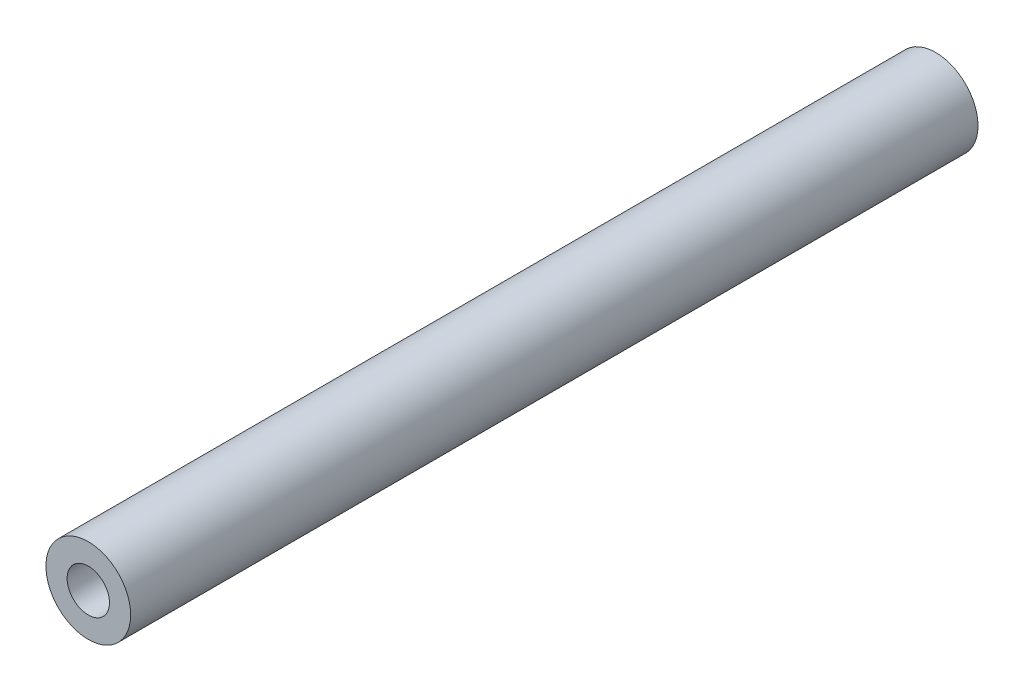
ISO-10303-21;
HEADER;
FILE_DESCRIPTION(('STEP AP214'),'2;1');
FILE_NAME('part.step','',(''),(''),'','','');
FILE_SCHEMA(('AUTOMOTIVE_DESIGN { 1 0 10303 214 1 1 1 1 }'));
ENDSEC;
DATA;
#1=APPLICATION_CONTEXT('core data for automotive mechanical design processes');
#2=APPLICATION_PROTOCOL_DEFINITION('international standard','automotive_design',2000,#1);
#3=PRODUCT_CONTEXT('',#1,'mechanical');
#4=PRODUCT('Part','Part','',(#3));
#5=PRODUCT_RELATED_PRODUCT_CATEGORY('part','',(#4));
#6=PRODUCT_DEFINITION_FORMATION('','',#4);
#7=PRODUCT_DEFINITION_CONTEXT('part definition',#1,'design');
#8=PRODUCT_DEFINITION('design','',#6,#7);
#9=PRODUCT_DEFINITION_SHAPE('','',#8);
#10=(LENGTH_UNIT() NAMED_UNIT(*) SI_UNIT(.MILLI.,.METRE.));
#11=(NAMED_UNIT(*) PLANE_ANGLE_UNIT() SI_UNIT($,.RADIAN.));
#12=(NAMED_UNIT(*) SI_UNIT($,.STERADIAN.) SOLID_ANGLE_UNIT());
#13=UNCERTAINTY_MEASURE_WITH_UNIT(LENGTH_MEASURE(1.E-05),#10,'distance_accuracy_value','');
#14=(GEOMETRIC_REPRESENTATION_CONTEXT(3) GLOBAL_UNCERTAINTY_ASSIGNED_CONTEXT((#13)) GLOBAL_UNIT_ASSIGNED_CONTEXT((#10,
#11,#12)) REPRESENTATION_CONTEXT('',''));
#15=CARTESIAN_POINT('',(0.,0.,0.));
#16=DIRECTION('',(0.,0.,1.));
#17=DIRECTION('',(1.,0.,0.));
#18=AXIS2_PLACEMENT_3D('',#15,#16,#17);
#19=CARTESIAN_POINT('',(-1.62237440089522E-13,0.,87.3999997615819));
#20=DIRECTION('',(0.,0.,1.));
#21=DIRECTION('',(1.,0.,0.));
#22=AXIS2_PLACEMENT_3D('',#19,#20,#21);
#23=CYLINDRICAL_SURFACE('',#22,1.);
#24=CARTESIAN_POINT('',(1.34986247086613E-13,-1.46706703801243E-13,21.8036022455206));
#25=DIRECTION('',(0.,0.,1.));
#26=DIRECTION('',(1.,0.,0.));
#27=AXIS2_PLACEMENT_3D('',#24,#25,#26);
#28=CIRCLE('',#27,1.);
#29=CARTESIAN_POINT('',(1.00000000000014,-1.46706703801243E-13,21.8036022455206));
#30=VERTEX_POINT('',#29);
#31=EDGE_CURVE('E27',#30,#30,#28,.F.);
#32=ORIENTED_EDGE('',*,*,#31,.T.);
#33=EDGE_LOOP('',(#32));
#34=FACE_BOUND('',#33,.T.);
#35=CARTESIAN_POINT('',(0.,0.,61.8039997615819));
#36=DIRECTION('',(0.,0.,1.));
#37=DIRECTION('',(1.,0.,0.));
#38=AXIS2_PLACEMENT_3D('',#35,#36,#37);
#39=CIRCLE('',#38,1.);
#40=CARTESIAN_POINT('',(0.999999999999954,0.,61.8039997615819));
#41=VERTEX_POINT('',#40);
#42=EDGE_CURVE('E18',#41,#41,#39,.F.);
#43=ORIENTED_EDGE('',*,*,#42,.F.);
#44=EDGE_LOOP('',(#43));
#45=FACE_BOUND('',#44,.T.);
#46=ADVANCED_FACE('F15',(#34,#45),#23,.F.);
#47=CARTESIAN_POINT('',(0.,0.,61.8039997615819));
#48=DIRECTION('',(0.,0.,1.));
#49=DIRECTION('',(1.,0.,0.));
#50=AXIS2_PLACEMENT_3D('',#47,#48,#49);
#51=PLANE('',#50);
#52=ORIENTED_EDGE('',*,*,#42,.T.);
#53=EDGE_LOOP('',(#52));
#54=FACE_BOUND('',#53,.T.);
#55=CARTESIAN_POINT('',(0.,0.,61.8039997615819));
#56=DIRECTION('',(0.,0.,1.));
#57=DIRECTION('',(1.,0.,0.));
#58=AXIS2_PLACEMENT_3D('',#55,#56,#57);
#59=CIRCLE('',#58,2.);
#60=CARTESIAN_POINT('',(1.99999999999995,0.,61.8039997615819));
#61=VERTEX_POINT('',#60);
#62=EDGE_CURVE('E22',#61,#61,#59,.F.);
#63=ORIENTED_EDGE('',*,*,#62,.F.);
#64=EDGE_LOOP('',(#63));
#65=FACE_BOUND('',#64,.T.);
#66=ADVANCED_FACE('F35',(#54,#65),#51,.T.);
#67=CARTESIAN_POINT('',(1.3521891701919E-13,-1.46669118467917E-13,21.8036022455206));
#68=DIRECTION('',(0.,0.,1.));
#69=DIRECTION('',(1.,0.,0.));
#70=AXIS2_PLACEMENT_3D('',#67,#68,#69);
#71=PLANE('',#70);
#72=ORIENTED_EDGE('',*,*,#31,.F.);
#73=EDGE_LOOP('',(#72));
#74=FACE_BOUND('',#73,.T.);
#75=CARTESIAN_POINT('',(1.34986247086613E-13,-1.46706703801243E-13,21.8036022455206));
#76=DIRECTION('',(0.,0.,1.));
#77=DIRECTION('',(1.,0.,0.));
#78=AXIS2_PLACEMENT_3D('',#75,#76,#77);
#79=CIRCLE('',#78,2.);
#80=CARTESIAN_POINT('',(2.00000000000014,-1.46706703801243E-13,21.8036022455206));
#81=VERTEX_POINT('',#80);
#82=EDGE_CURVE('E10',#81,#81,#79,.T.);
#83=ORIENTED_EDGE('',*,*,#82,.F.);
#84=EDGE_LOOP('',(#83));
#85=FACE_BOUND('',#84,.T.);
#86=ADVANCED_FACE('F43',(#74,#85),#71,.F.);
#87=CARTESIAN_POINT('',(-1.62237440089522E-13,0.,87.3999997615819));
#88=DIRECTION('',(0.,0.,1.));
#89=DIRECTION('',(1.,0.,0.));
#90=AXIS2_PLACEMENT_3D('',#87,#88,#89);
#91=CYLINDRICAL_SURFACE('',#90,2.);
#92=ORIENTED_EDGE('',*,*,#82,.T.);
#93=EDGE_LOOP('',(#92));
#94=FACE_BOUND('',#93,.T.);
#95=ORIENTED_EDGE('',*,*,#62,.T.);
#96=EDGE_LOOP('',(#95));
#97=FACE_BOUND('',#96,.T.);
#98=ADVANCED_FACE('F44',(#94,#97),#91,.T.);
#99=CLOSED_SHELL('',(#46,#66,#86,#98));
#100=MANIFOLD_SOLID_BREP('B1',#99);
#101=ADVANCED_BREP_SHAPE_REPRESENTATION('',(#18,#100),#14);
#102=SHAPE_DEFINITION_REPRESENTATION(#9,#101);
ENDSEC;
END-ISO-10303-21;
